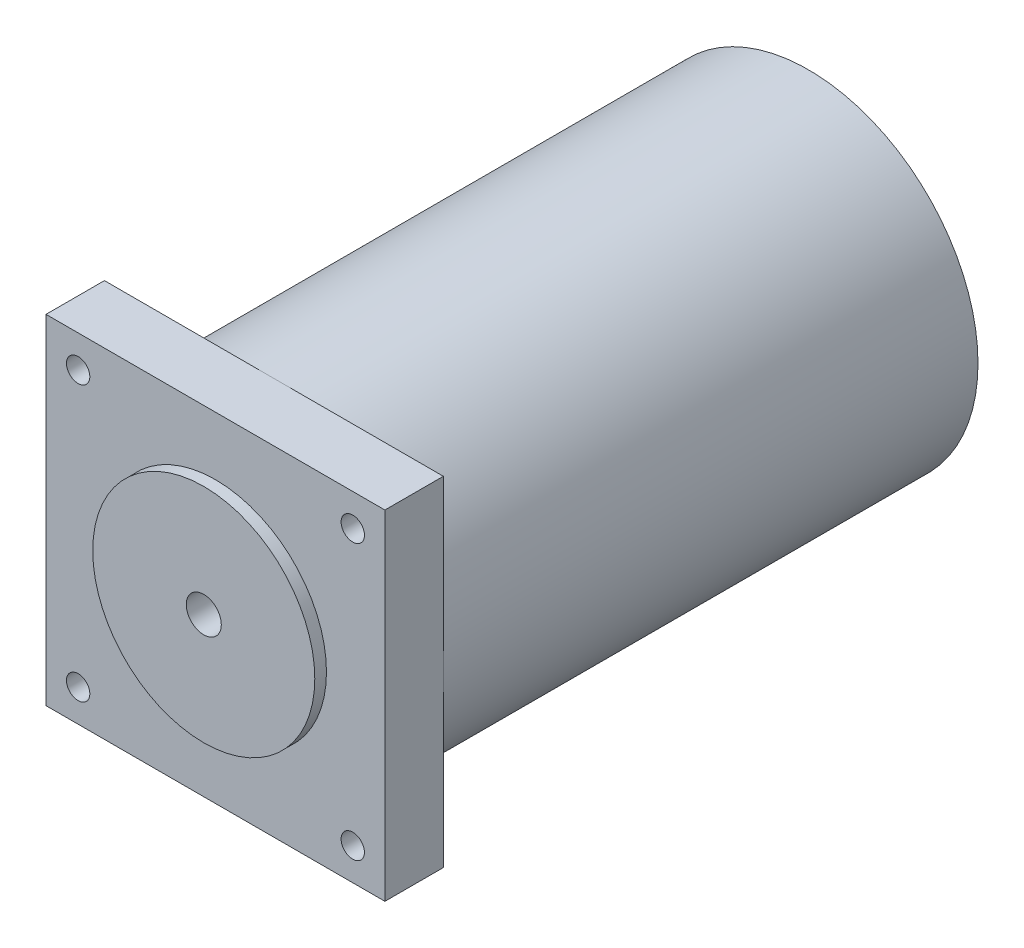
ISO-10303-21;
HEADER;
FILE_DESCRIPTION(('STEP AP214'),'2;1');
FILE_NAME('part.step','',(''),(''),'','','');
FILE_SCHEMA(('AUTOMOTIVE_DESIGN { 1 0 10303 214 1 1 1 1 }'));
ENDSEC;
DATA;
#1=APPLICATION_CONTEXT('core data for automotive mechanical design processes');
#2=APPLICATION_PROTOCOL_DEFINITION('international standard','automotive_design',2000,#1);
#3=PRODUCT_CONTEXT('',#1,'mechanical');
#4=PRODUCT('Part','Part','',(#3));
#5=PRODUCT_RELATED_PRODUCT_CATEGORY('part','',(#4));
#6=PRODUCT_DEFINITION_FORMATION('','',#4);
#7=PRODUCT_DEFINITION_CONTEXT('part definition',#1,'design');
#8=PRODUCT_DEFINITION('design','',#6,#7);
#9=PRODUCT_DEFINITION_SHAPE('','',#8);
#10=(LENGTH_UNIT() NAMED_UNIT(*) SI_UNIT(.MILLI.,.METRE.));
#11=(NAMED_UNIT(*) PLANE_ANGLE_UNIT() SI_UNIT($,.RADIAN.));
#12=(NAMED_UNIT(*) SI_UNIT($,.STERADIAN.) SOLID_ANGLE_UNIT());
#13=UNCERTAINTY_MEASURE_WITH_UNIT(LENGTH_MEASURE(1.E-05),#10,'distance_accuracy_value','');
#14=(GEOMETRIC_REPRESENTATION_CONTEXT(3) GLOBAL_UNCERTAINTY_ASSIGNED_CONTEXT((#13)) GLOBAL_UNIT_ASSIGNED_CONTEXT((#10,
#11,#12)) REPRESENTATION_CONTEXT('',''));
#15=CARTESIAN_POINT('',(0.,0.,0.));
#16=DIRECTION('',(0.,0.,1.));
#17=DIRECTION('',(1.,0.,0.));
#18=AXIS2_PLACEMENT_3D('',#15,#16,#17);
#19=CARTESIAN_POINT('',(0.,0.,-12.));
#20=DIRECTION('',(0.,0.,-1.));
#21=DIRECTION('',(-1.,0.,0.));
#22=AXIS2_PLACEMENT_3D('',#19,#20,#21);
#23=PLANE('',#22);
#24=CARTESIAN_POINT('',(-23.5,23.5,-12.));
#25=DIRECTION('',(0.,0.,1.));
#26=DIRECTION('',(1.,0.,0.));
#27=AXIS2_PLACEMENT_3D('',#24,#25,#26);
#28=CIRCLE('',#27,2.);
#29=CARTESIAN_POINT('',(-21.5,23.5,-12.));
#30=VERTEX_POINT('',#29);
#31=EDGE_CURVE('E112',#30,#30,#28,.T.);
#32=ORIENTED_EDGE('',*,*,#31,.T.);
#33=EDGE_LOOP('',(#32));
#34=FACE_BOUND('',#33,.T.);
#35=CARTESIAN_POINT('',(0.,0.,-12.));
#36=DIRECTION('',(0.,0.,-1.));
#37=DIRECTION('',(-1.,0.,0.));
#38=AXIS2_PLACEMENT_3D('',#35,#36,#37);
#39=CIRCLE('',#38,29.);
#40=CARTESIAN_POINT('',(-29.,0.,-12.));
#41=VERTEX_POINT('',#40);
#42=CARTESIAN_POINT('',(0.,29.,-12.));
#43=VERTEX_POINT('',#42);
#44=EDGE_CURVE('E47',#41,#43,#39,.T.);
#45=ORIENTED_EDGE('',*,*,#44,.F.);
#46=DIRECTION('',(0.,1.,0.));
#47=VECTOR('',#46,1.);
#48=CARTESIAN_POINT('',(-29.,29.,-12.));
#49=LINE('',#48,#47);
#50=CARTESIAN_POINT('',(-29.,29.,-12.));
#51=VERTEX_POINT('',#50);
#52=EDGE_CURVE('E97',#41,#51,#49,.T.);
#53=ORIENTED_EDGE('',*,*,#52,.T.);
#54=DIRECTION('',(1.,0.,0.));
#55=VECTOR('',#54,1.);
#56=CARTESIAN_POINT('',(29.,29.,-12.));
#57=LINE('',#56,#55);
#58=EDGE_CURVE('E109',#51,#43,#57,.T.);
#59=ORIENTED_EDGE('',*,*,#58,.T.);
#60=EDGE_LOOP('',(#45,#53,#59));
#61=FACE_BOUND('',#60,.T.);
#62=ADVANCED_FACE('F36',(#34,#61),#23,.T.);
#63=CARTESIAN_POINT('',(23.5,23.5,-12.));
#64=DIRECTION('',(0.,0.,1.));
#65=DIRECTION('',(-1.,0.,0.));
#66=AXIS2_PLACEMENT_3D('',#63,#64,#65);
#67=CIRCLE('',#66,2.);
#68=CARTESIAN_POINT('',(21.5,23.5,-12.));
#69=VERTEX_POINT('',#68);
#70=EDGE_CURVE('E220',#69,#69,#67,.T.);
#71=ORIENTED_EDGE('',*,*,#70,.T.);
#72=EDGE_LOOP('',(#71));
#73=FACE_BOUND('',#72,.T.);
#74=CARTESIAN_POINT('',(29.,0.,-12.));
#75=VERTEX_POINT('',#74);
#76=EDGE_CURVE('E11',#43,#75,#39,.T.);
#77=ORIENTED_EDGE('',*,*,#76,.F.);
#78=CARTESIAN_POINT('',(29.,29.,-12.));
#79=VERTEX_POINT('',#78);
#80=EDGE_CURVE('E96',#43,#79,#57,.T.);
#81=ORIENTED_EDGE('',*,*,#80,.T.);
#82=DIRECTION('',(0.,-1.,0.));
#83=VECTOR('',#82,1.);
#84=CARTESIAN_POINT('',(29.,29.,-12.));
#85=LINE('',#84,#83);
#86=EDGE_CURVE('E120',#79,#75,#85,.T.);
#87=ORIENTED_EDGE('',*,*,#86,.T.);
#88=EDGE_LOOP('',(#77,#81,#87));
#89=FACE_BOUND('',#88,.T.);
#90=ADVANCED_FACE('F164',(#73,#89),#23,.T.);
#91=CARTESIAN_POINT('',(23.5,-23.5,-12.));
#92=DIRECTION('',(0.,0.,1.));
#93=DIRECTION('',(1.,0.,0.));
#94=AXIS2_PLACEMENT_3D('',#91,#92,#93);
#95=CIRCLE('',#94,2.);
#96=CARTESIAN_POINT('',(25.5,-23.5,-12.));
#97=VERTEX_POINT('',#96);
#98=EDGE_CURVE('E214',#97,#97,#95,.T.);
#99=ORIENTED_EDGE('',*,*,#98,.T.);
#100=EDGE_LOOP('',(#99));
#101=FACE_BOUND('',#100,.T.);
#102=CARTESIAN_POINT('',(0.,-29.,-12.));
#103=VERTEX_POINT('',#102);
#104=EDGE_CURVE('E45',#75,#103,#39,.T.);
#105=ORIENTED_EDGE('',*,*,#104,.F.);
#106=CARTESIAN_POINT('',(29.,-29.,-12.));
#107=VERTEX_POINT('',#106);
#108=EDGE_CURVE('E122',#75,#107,#85,.T.);
#109=ORIENTED_EDGE('',*,*,#108,.T.);
#110=DIRECTION('',(-1.,0.,0.));
#111=VECTOR('',#110,1.);
#112=CARTESIAN_POINT('',(29.,-29.,-12.));
#113=LINE('',#112,#111);
#114=EDGE_CURVE('E107',#107,#103,#113,.T.);
#115=ORIENTED_EDGE('',*,*,#114,.T.);
#116=EDGE_LOOP('',(#105,#109,#115));
#117=FACE_BOUND('',#116,.T.);
#118=ADVANCED_FACE('F166',(#101,#117),#23,.T.);
#119=CARTESIAN_POINT('',(0.,0.,-2.));
#120=DIRECTION('',(0.,0.,1.));
#121=DIRECTION('',(1.,0.,0.));
#122=AXIS2_PLACEMENT_3D('',#119,#120,#121);
#123=CYLINDRICAL_SURFACE('',#122,19.);
#124=CARTESIAN_POINT('',(0.,0.,-2.));
#125=DIRECTION('',(0.,0.,-1.));
#126=DIRECTION('',(-1.,0.,0.));
#127=AXIS2_PLACEMENT_3D('',#124,#125,#126);
#128=CIRCLE('',#127,19.);
#129=CARTESIAN_POINT('',(-19.,0.,-2.));
#130=VERTEX_POINT('',#129);
#131=EDGE_CURVE('E116',#130,#130,#128,.F.);
#132=ORIENTED_EDGE('',*,*,#131,.T.);
#133=EDGE_LOOP('',(#132));
#134=FACE_BOUND('',#133,.T.);
#135=CARTESIAN_POINT('',(0.,0.,0.));
#136=DIRECTION('',(0.,0.,1.));
#137=DIRECTION('',(1.,0.,0.));
#138=AXIS2_PLACEMENT_3D('',#135,#136,#137);
#139=CIRCLE('',#138,19.);
#140=CARTESIAN_POINT('',(19.,0.,0.));
#141=VERTEX_POINT('',#140);
#142=EDGE_CURVE('E40',#141,#141,#139,.T.);
#143=ORIENTED_EDGE('',*,*,#142,.F.);
#144=EDGE_LOOP('',(#143));
#145=FACE_BOUND('',#144,.T.);
#146=ADVANCED_FACE('F38',(#134,#145),#123,.T.);
#147=CARTESIAN_POINT('',(0.,0.,0.));
#148=DIRECTION('',(0.,0.,1.));
#149=DIRECTION('',(1.,0.,0.));
#150=AXIS2_PLACEMENT_3D('',#147,#148,#149);
#151=PLANE('',#150);
#152=CARTESIAN_POINT('',(0.,0.,0.));
#153=DIRECTION('',(0.,0.,1.));
#154=DIRECTION('',(1.,0.,0.));
#155=AXIS2_PLACEMENT_3D('',#152,#153,#154);
#156=CIRCLE('',#155,3.);
#157=CARTESIAN_POINT('',(3.,0.,0.));
#158=VERTEX_POINT('',#157);
#159=EDGE_CURVE('E199',#158,#158,#156,.T.);
#160=ORIENTED_EDGE('',*,*,#159,.F.);
#161=EDGE_LOOP('',(#160));
#162=FACE_BOUND('',#161,.T.);
#163=ORIENTED_EDGE('',*,*,#142,.T.);
#164=EDGE_LOOP('',(#163));
#165=FACE_BOUND('',#164,.T.);
#166=ADVANCED_FACE('F190',(#162,#165),#151,.T.);
#167=CARTESIAN_POINT('',(29.,29.,-12.));
#168=DIRECTION('',(-1.,0.,0.));
#169=DIRECTION('',(0.,0.,1.));
#170=AXIS2_PLACEMENT_3D('',#167,#168,#169);
#171=PLANE('',#170);
#172=DIRECTION('',(0.,-1.,0.));
#173=VECTOR('',#172,1.);
#174=CARTESIAN_POINT('',(29.,29.,-2.));
#175=LINE('',#174,#173);
#176=CARTESIAN_POINT('',(29.,29.,-2.));
#177=VERTEX_POINT('',#176);
#178=CARTESIAN_POINT('',(29.,-29.,-2.));
#179=VERTEX_POINT('',#178);
#180=EDGE_CURVE('E127',#177,#179,#175,.T.);
#181=ORIENTED_EDGE('',*,*,#180,.T.);
#182=DIRECTION('',(0.,0.,1.));
#183=VECTOR('',#182,1.);
#184=CARTESIAN_POINT('',(29.,-29.,-12.));
#185=LINE('',#184,#183);
#186=EDGE_CURVE('E141',#107,#179,#185,.T.);
#187=ORIENTED_EDGE('',*,*,#186,.F.);
#188=ORIENTED_EDGE('',*,*,#108,.F.);
#189=ORIENTED_EDGE('',*,*,#86,.F.);
#190=DIRECTION('',(0.,0.,1.));
#191=VECTOR('',#190,1.);
#192=CARTESIAN_POINT('',(29.,29.,-12.));
#193=LINE('',#192,#191);
#194=EDGE_CURVE('E126',#79,#177,#193,.T.);
#195=ORIENTED_EDGE('',*,*,#194,.T.);
#196=EDGE_LOOP('',(#181,#187,#188,#189,#195));
#197=FACE_BOUND('',#196,.T.);
#198=ADVANCED_FACE('F158',(#197),#171,.F.);
#199=CARTESIAN_POINT('',(29.,-29.,-12.));
#200=DIRECTION('',(0.,1.,0.));
#201=DIRECTION('',(-1.,0.,0.));
#202=AXIS2_PLACEMENT_3D('',#199,#200,#201);
#203=PLANE('',#202);
#204=DIRECTION('',(-1.,0.,0.));
#205=VECTOR('',#204,1.);
#206=CARTESIAN_POINT('',(29.,-29.,-2.));
#207=LINE('',#206,#205);
#208=CARTESIAN_POINT('',(-29.,-29.,-2.));
#209=VERTEX_POINT('',#208);
#210=EDGE_CURVE('E130',#179,#209,#207,.T.);
#211=ORIENTED_EDGE('',*,*,#210,.T.);
#212=DIRECTION('',(0.,0.,1.));
#213=VECTOR('',#212,1.);
#214=CARTESIAN_POINT('',(-29.,-29.,-12.));
#215=LINE('',#214,#213);
#216=CARTESIAN_POINT('',(-29.,-29.,-12.));
#217=VERTEX_POINT('',#216);
#218=EDGE_CURVE('E139',#217,#209,#215,.T.);
#219=ORIENTED_EDGE('',*,*,#218,.F.);
#220=EDGE_CURVE('E92',#103,#217,#113,.T.);
#221=ORIENTED_EDGE('',*,*,#220,.F.);
#222=ORIENTED_EDGE('',*,*,#114,.F.);
#223=ORIENTED_EDGE('',*,*,#186,.T.);
#224=EDGE_LOOP('',(#211,#219,#221,#222,#223));
#225=FACE_BOUND('',#224,.T.);
#226=ADVANCED_FACE('F185',(#225),#203,.F.);
#227=CARTESIAN_POINT('',(-29.,29.,-12.));
#228=DIRECTION('',(1.,0.,0.));
#229=DIRECTION('',(0.,0.,-1.));
#230=AXIS2_PLACEMENT_3D('',#227,#228,#229);
#231=PLANE('',#230);
#232=DIRECTION('',(0.,1.,0.));
#233=VECTOR('',#232,1.);
#234=CARTESIAN_POINT('',(-29.,29.,-2.));
#235=LINE('',#234,#233);
#236=CARTESIAN_POINT('',(-29.,29.,-2.));
#237=VERTEX_POINT('',#236);
#238=EDGE_CURVE('E132',#209,#237,#235,.T.);
#239=ORIENTED_EDGE('',*,*,#238,.T.);
#240=DIRECTION('',(0.,0.,1.));
#241=VECTOR('',#240,1.);
#242=CARTESIAN_POINT('',(-29.,29.,-12.));
#243=LINE('',#242,#241);
#244=EDGE_CURVE('E103',#51,#237,#243,.T.);
#245=ORIENTED_EDGE('',*,*,#244,.F.);
#246=ORIENTED_EDGE('',*,*,#52,.F.);
#247=EDGE_CURVE('E89',#217,#41,#49,.T.);
#248=ORIENTED_EDGE('',*,*,#247,.F.);
#249=ORIENTED_EDGE('',*,*,#218,.T.);
#250=EDGE_LOOP('',(#239,#245,#246,#248,#249));
#251=FACE_BOUND('',#250,.T.);
#252=ADVANCED_FACE('F101',(#251),#231,.F.);
#253=CARTESIAN_POINT('',(29.,29.,-12.));
#254=DIRECTION('',(0.,-1.,0.));
#255=DIRECTION('',(0.,0.,-1.));
#256=AXIS2_PLACEMENT_3D('',#253,#254,#255);
#257=PLANE('',#256);
#258=DIRECTION('',(1.,0.,0.));
#259=VECTOR('',#258,1.);
#260=CARTESIAN_POINT('',(29.,29.,-2.));
#261=LINE('',#260,#259);
#262=EDGE_CURVE('E134',#237,#177,#261,.T.);
#263=ORIENTED_EDGE('',*,*,#262,.T.);
#264=ORIENTED_EDGE('',*,*,#194,.F.);
#265=ORIENTED_EDGE('',*,*,#80,.F.);
#266=ORIENTED_EDGE('',*,*,#58,.F.);
#267=ORIENTED_EDGE('',*,*,#244,.T.);
#268=EDGE_LOOP('',(#263,#264,#265,#266,#267));
#269=FACE_BOUND('',#268,.T.);
#270=ADVANCED_FACE('F163',(#269),#257,.F.);
#271=CARTESIAN_POINT('',(-23.5,-23.5,-12.));
#272=DIRECTION('',(0.,0.,1.));
#273=DIRECTION('',(-1.,0.,0.));
#274=AXIS2_PLACEMENT_3D('',#271,#272,#273);
#275=CIRCLE('',#274,2.);
#276=CARTESIAN_POINT('',(-25.5,-23.5,-12.));
#277=VERTEX_POINT('',#276);
#278=EDGE_CURVE('E208',#277,#277,#275,.T.);
#279=ORIENTED_EDGE('',*,*,#278,.T.);
#280=EDGE_LOOP('',(#279));
#281=FACE_BOUND('',#280,.T.);
#282=EDGE_CURVE('E60',#103,#41,#39,.T.);
#283=ORIENTED_EDGE('',*,*,#282,.F.);
#284=ORIENTED_EDGE('',*,*,#220,.T.);
#285=ORIENTED_EDGE('',*,*,#247,.T.);
#286=EDGE_LOOP('',(#283,#284,#285));
#287=FACE_BOUND('',#286,.T.);
#288=ADVANCED_FACE('F91',(#281,#287),#23,.T.);
#289=CARTESIAN_POINT('',(0.,0.,-2.));
#290=DIRECTION('',(0.,0.,-1.));
#291=DIRECTION('',(-1.,0.,0.));
#292=AXIS2_PLACEMENT_3D('',#289,#290,#291);
#293=PLANE('',#292);
#294=CARTESIAN_POINT('',(-23.5,-23.5,-2.));
#295=DIRECTION('',(0.,0.,1.));
#296=DIRECTION('',(-1.,0.,0.));
#297=AXIS2_PLACEMENT_3D('',#294,#295,#296);
#298=CIRCLE('',#297,2.);
#299=CARTESIAN_POINT('',(-25.5,-23.5,-2.));
#300=VERTEX_POINT('',#299);
#301=EDGE_CURVE('E205',#300,#300,#298,.T.);
#302=ORIENTED_EDGE('',*,*,#301,.F.);
#303=EDGE_LOOP('',(#302));
#304=FACE_BOUND('',#303,.T.);
#305=CARTESIAN_POINT('',(23.5,-23.5,-2.));
#306=DIRECTION('',(0.,0.,1.));
#307=DIRECTION('',(1.,0.,0.));
#308=AXIS2_PLACEMENT_3D('',#305,#306,#307);
#309=CIRCLE('',#308,2.);
#310=CARTESIAN_POINT('',(25.5,-23.5,-2.));
#311=VERTEX_POINT('',#310);
#312=EDGE_CURVE('E211',#311,#311,#309,.T.);
#313=ORIENTED_EDGE('',*,*,#312,.F.);
#314=EDGE_LOOP('',(#313));
#315=FACE_BOUND('',#314,.T.);
#316=CARTESIAN_POINT('',(23.5,23.5,-2.));
#317=DIRECTION('',(0.,0.,1.));
#318=DIRECTION('',(-1.,0.,0.));
#319=AXIS2_PLACEMENT_3D('',#316,#317,#318);
#320=CIRCLE('',#319,2.);
#321=CARTESIAN_POINT('',(21.5,23.5,-2.));
#322=VERTEX_POINT('',#321);
#323=EDGE_CURVE('E217',#322,#322,#320,.T.);
#324=ORIENTED_EDGE('',*,*,#323,.F.);
#325=EDGE_LOOP('',(#324));
#326=FACE_BOUND('',#325,.T.);
#327=CARTESIAN_POINT('',(-23.5,23.5,-2.));
#328=DIRECTION('',(0.,0.,1.));
#329=DIRECTION('',(1.,0.,0.));
#330=AXIS2_PLACEMENT_3D('',#327,#328,#329);
#331=CIRCLE('',#330,2.);
#332=CARTESIAN_POINT('',(-21.5,23.5,-2.));
#333=VERTEX_POINT('',#332);
#334=EDGE_CURVE('E222',#333,#333,#331,.T.);
#335=ORIENTED_EDGE('',*,*,#334,.F.);
#336=EDGE_LOOP('',(#335));
#337=FACE_BOUND('',#336,.T.);
#338=ORIENTED_EDGE('',*,*,#131,.F.);
#339=EDGE_LOOP('',(#338));
#340=FACE_BOUND('',#339,.T.);
#341=ORIENTED_EDGE('',*,*,#180,.F.);
#342=ORIENTED_EDGE('',*,*,#262,.F.);
#343=ORIENTED_EDGE('',*,*,#238,.F.);
#344=ORIENTED_EDGE('',*,*,#210,.F.);
#345=EDGE_LOOP('',(#341,#342,#343,#344));
#346=FACE_BOUND('',#345,.T.);
#347=ADVANCED_FACE('F148',(#304,#315,#326,#337,#340,#346),#293,.F.);
#348=CARTESIAN_POINT('',(0.,0.,-103.5));
#349=DIRECTION('',(0.,0.,1.));
#350=DIRECTION('',(1.,0.,0.));
#351=AXIS2_PLACEMENT_3D('',#348,#349,#350);
#352=CYLINDRICAL_SURFACE('',#351,29.);
#353=CARTESIAN_POINT('',(0.,0.,-103.5));
#354=DIRECTION('',(0.,0.,-1.));
#355=DIRECTION('',(-1.,0.,0.));
#356=AXIS2_PLACEMENT_3D('',#353,#354,#355);
#357=CIRCLE('',#356,29.);
#358=CARTESIAN_POINT('',(-29.,0.,-103.5));
#359=VERTEX_POINT('',#358);
#360=EDGE_CURVE('E111',#359,#359,#357,.T.);
#361=ORIENTED_EDGE('',*,*,#360,.F.);
#362=EDGE_LOOP('',(#361));
#363=FACE_BOUND('',#362,.T.);
#364=ORIENTED_EDGE('',*,*,#44,.T.);
#365=ORIENTED_EDGE('',*,*,#76,.T.);
#366=ORIENTED_EDGE('',*,*,#104,.T.);
#367=ORIENTED_EDGE('',*,*,#282,.T.);
#368=EDGE_LOOP('',(#364,#365,#366,#367));
#369=FACE_BOUND('',#368,.T.);
#370=ADVANCED_FACE('F114',(#363,#369),#352,.T.);
#371=CARTESIAN_POINT('',(0.,0.,-103.5));
#372=DIRECTION('',(0.,0.,-1.));
#373=DIRECTION('',(-1.,0.,0.));
#374=AXIS2_PLACEMENT_3D('',#371,#372,#373);
#375=PLANE('',#374);
#376=ORIENTED_EDGE('',*,*,#360,.T.);
#377=EDGE_LOOP('',(#376));
#378=FACE_BOUND('',#377,.T.);
#379=ADVANCED_FACE('F233',(#378),#375,.T.);
#380=CARTESIAN_POINT('',(-23.5,23.5,-12.));
#381=DIRECTION('',(0.,0.,1.));
#382=DIRECTION('',(1.,0.,0.));
#383=AXIS2_PLACEMENT_3D('',#380,#381,#382);
#384=CYLINDRICAL_SURFACE('',#383,2.);
#385=ORIENTED_EDGE('',*,*,#31,.F.);
#386=EDGE_LOOP('',(#385));
#387=FACE_BOUND('',#386,.T.);
#388=ORIENTED_EDGE('',*,*,#334,.T.);
#389=EDGE_LOOP('',(#388));
#390=FACE_BOUND('',#389,.T.);
#391=ADVANCED_FACE('F229',(#387,#390),#384,.F.);
#392=CARTESIAN_POINT('',(23.5,23.5,-12.));
#393=DIRECTION('',(0.,0.,1.));
#394=DIRECTION('',(1.,0.,0.));
#395=AXIS2_PLACEMENT_3D('',#392,#393,#394);
#396=CYLINDRICAL_SURFACE('',#395,2.);
#397=ORIENTED_EDGE('',*,*,#70,.F.);
#398=EDGE_LOOP('',(#397));
#399=FACE_BOUND('',#398,.T.);
#400=ORIENTED_EDGE('',*,*,#323,.T.);
#401=EDGE_LOOP('',(#400));
#402=FACE_BOUND('',#401,.T.);
#403=ADVANCED_FACE('F232',(#399,#402),#396,.F.);
#404=CARTESIAN_POINT('',(23.5,-23.5,-12.));
#405=DIRECTION('',(0.,0.,1.));
#406=DIRECTION('',(1.,0.,0.));
#407=AXIS2_PLACEMENT_3D('',#404,#405,#406);
#408=CYLINDRICAL_SURFACE('',#407,2.);
#409=ORIENTED_EDGE('',*,*,#98,.F.);
#410=EDGE_LOOP('',(#409));
#411=FACE_BOUND('',#410,.T.);
#412=ORIENTED_EDGE('',*,*,#312,.T.);
#413=EDGE_LOOP('',(#412));
#414=FACE_BOUND('',#413,.T.);
#415=ADVANCED_FACE('F240',(#411,#414),#408,.F.);
#416=CARTESIAN_POINT('',(-23.5,-23.5,-12.));
#417=DIRECTION('',(0.,0.,1.));
#418=DIRECTION('',(1.,0.,0.));
#419=AXIS2_PLACEMENT_3D('',#416,#417,#418);
#420=CYLINDRICAL_SURFACE('',#419,2.);
#421=ORIENTED_EDGE('',*,*,#278,.F.);
#422=EDGE_LOOP('',(#421));
#423=FACE_BOUND('',#422,.T.);
#424=ORIENTED_EDGE('',*,*,#301,.T.);
#425=EDGE_LOOP('',(#424));
#426=FACE_BOUND('',#425,.T.);
#427=ADVANCED_FACE('F248',(#423,#426),#420,.F.);
#428=CARTESIAN_POINT('',(0.,0.,-12.));
#429=DIRECTION('',(0.,0.,1.));
#430=DIRECTION('',(1.,0.,0.));
#431=AXIS2_PLACEMENT_3D('',#428,#429,#430);
#432=CYLINDRICAL_SURFACE('',#431,3.);
#433=CARTESIAN_POINT('',(0.,0.,-12.));
#434=DIRECTION('',(0.,0.,1.));
#435=DIRECTION('',(1.,0.,0.));
#436=AXIS2_PLACEMENT_3D('',#433,#434,#435);
#437=CIRCLE('',#436,3.);
#438=CARTESIAN_POINT('',(3.,0.,-12.));
#439=VERTEX_POINT('',#438);
#440=EDGE_CURVE('E202',#439,#439,#437,.T.);
#441=ORIENTED_EDGE('',*,*,#440,.F.);
#442=EDGE_LOOP('',(#441));
#443=FACE_BOUND('',#442,.T.);
#444=ORIENTED_EDGE('',*,*,#159,.T.);
#445=EDGE_LOOP('',(#444));
#446=FACE_BOUND('',#445,.T.);
#447=ADVANCED_FACE('F252',(#443,#446),#432,.F.);
#448=CARTESIAN_POINT('',(0.,0.,-12.));
#449=DIRECTION('',(0.,0.,1.));
#450=DIRECTION('',(1.,0.,0.));
#451=AXIS2_PLACEMENT_3D('',#448,#449,#450);
#452=PLANE('',#451);
#453=ORIENTED_EDGE('',*,*,#440,.T.);
#454=EDGE_LOOP('',(#453));
#455=FACE_BOUND('',#454,.T.);
#456=ADVANCED_FACE('F256',(#455),#452,.T.);
#457=CLOSED_SHELL('',(#62,#90,#118,#146,#166,#198,#226,#252,#270,#288,#347,#370,#379,#391,#403,
#415,#427,#447,#456));
#458=MANIFOLD_SOLID_BREP('B2',#457);
#459=ADVANCED_BREP_SHAPE_REPRESENTATION('',(#18,#458),#14);
#460=SHAPE_DEFINITION_REPRESENTATION(#9,#459);
ENDSEC;
END-ISO-10303-21;
